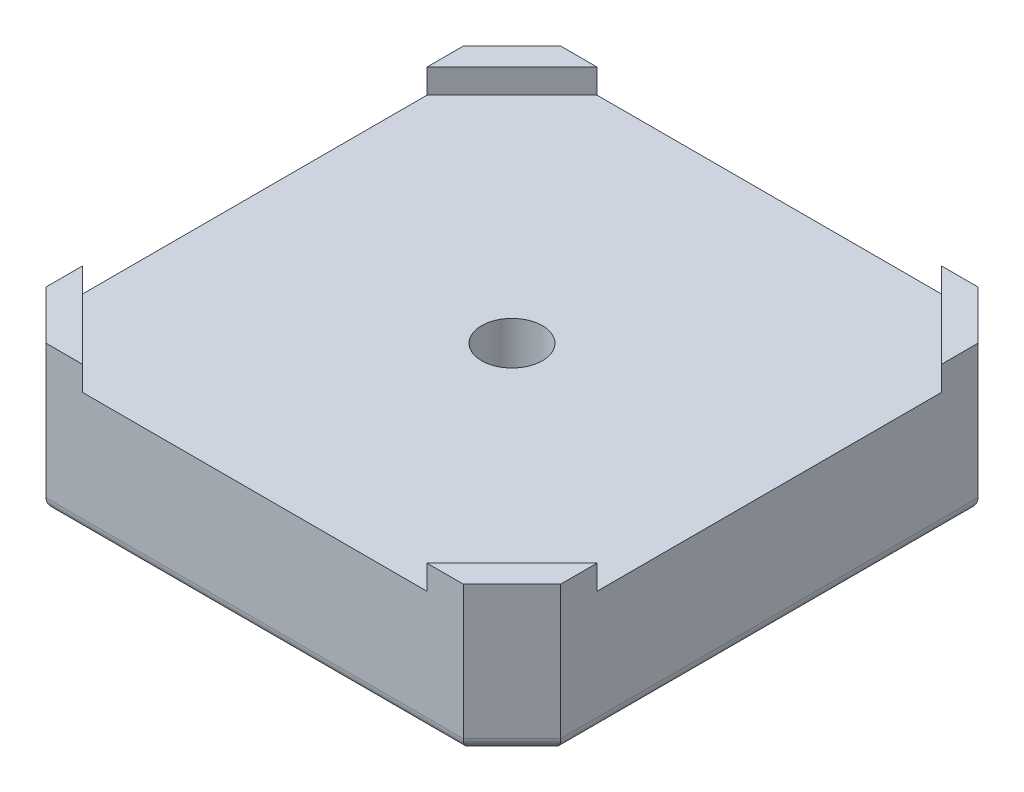
ISO-10303-21;
HEADER;
FILE_DESCRIPTION(('STEP AP214'),'2;1');
FILE_NAME('part.step','',(''),(''),'','','');
FILE_SCHEMA(('AUTOMOTIVE_DESIGN { 1 0 10303 214 1 1 1 1 }'));
ENDSEC;
DATA;
#1=APPLICATION_CONTEXT('core data for automotive mechanical design processes');
#2=APPLICATION_PROTOCOL_DEFINITION('international standard','automotive_design',2000,#1);
#3=PRODUCT_CONTEXT('',#1,'mechanical');
#4=PRODUCT('Part','Part','',(#3));
#5=PRODUCT_RELATED_PRODUCT_CATEGORY('part','',(#4));
#6=PRODUCT_DEFINITION_FORMATION('','',#4);
#7=PRODUCT_DEFINITION_CONTEXT('part definition',#1,'design');
#8=PRODUCT_DEFINITION('design','',#6,#7);
#9=PRODUCT_DEFINITION_SHAPE('','',#8);
#10=(LENGTH_UNIT() NAMED_UNIT(*) SI_UNIT(.MILLI.,.METRE.));
#11=(NAMED_UNIT(*) PLANE_ANGLE_UNIT() SI_UNIT($,.RADIAN.));
#12=(NAMED_UNIT(*) SI_UNIT($,.STERADIAN.) SOLID_ANGLE_UNIT());
#13=UNCERTAINTY_MEASURE_WITH_UNIT(LENGTH_MEASURE(1.E-05),#10,'distance_accuracy_value','');
#14=(GEOMETRIC_REPRESENTATION_CONTEXT(3) GLOBAL_UNCERTAINTY_ASSIGNED_CONTEXT((#13)) GLOBAL_UNIT_ASSIGNED_CONTEXT((#10,
#11,#12)) REPRESENTATION_CONTEXT('',''));
#15=CARTESIAN_POINT('',(0.,0.,0.));
#16=DIRECTION('',(0.,0.,1.));
#17=DIRECTION('',(1.,0.,0.));
#18=AXIS2_PLACEMENT_3D('',#15,#16,#17);
#19=CARTESIAN_POINT('',(0.,0.,0.));
#20=DIRECTION('',(0.,1.,0.));
#21=DIRECTION('',(0.,0.,1.));
#22=AXIS2_PLACEMENT_3D('',#19,#20,#21);
#23=PLANE('',#22);
#24=CARTESIAN_POINT('',(15.5,0.,-15.5));
#25=DIRECTION('',(0.,1.,0.));
#26=DIRECTION('',(0.,0.,1.));
#27=AXIS2_PLACEMENT_3D('',#24,#25,#26);
#28=CIRCLE('',#27,1.55);
#29=CARTESIAN_POINT('',(15.5,0.,-13.95));
#30=VERTEX_POINT('',#29);
#31=EDGE_CURVE('E401',#30,#30,#28,.T.);
#32=ORIENTED_EDGE('',*,*,#31,.T.);
#33=EDGE_LOOP('',(#32));
#34=FACE_BOUND('',#33,.T.);
#35=CARTESIAN_POINT('',(15.5,0.,15.5));
#36=DIRECTION('',(0.,1.,0.));
#37=DIRECTION('',(0.,0.,1.));
#38=AXIS2_PLACEMENT_3D('',#35,#36,#37);
#39=CIRCLE('',#38,1.55);
#40=CARTESIAN_POINT('',(15.5,0.,17.05));
#41=VERTEX_POINT('',#40);
#42=EDGE_CURVE('E398',#41,#41,#39,.T.);
#43=ORIENTED_EDGE('',*,*,#42,.T.);
#44=EDGE_LOOP('',(#43));
#45=FACE_BOUND('',#44,.T.);
#46=CARTESIAN_POINT('',(-15.5,0.,-15.5));
#47=DIRECTION('',(0.,1.,0.));
#48=DIRECTION('',(0.,0.,1.));
#49=AXIS2_PLACEMENT_3D('',#46,#47,#48);
#50=CIRCLE('',#49,1.55);
#51=CARTESIAN_POINT('',(-15.5,0.,-13.95));
#52=VERTEX_POINT('',#51);
#53=EDGE_CURVE('E395',#52,#52,#50,.T.);
#54=ORIENTED_EDGE('',*,*,#53,.T.);
#55=EDGE_LOOP('',(#54));
#56=FACE_BOUND('',#55,.T.);
#57=CARTESIAN_POINT('',(-15.5,0.,15.5));
#58=DIRECTION('',(0.,1.,0.));
#59=DIRECTION('',(0.,0.,1.));
#60=AXIS2_PLACEMENT_3D('',#57,#58,#59);
#61=CIRCLE('',#60,1.55);
#62=CARTESIAN_POINT('',(-15.5,0.,17.05));
#63=VERTEX_POINT('',#62);
#64=EDGE_CURVE('E392',#63,#63,#61,.T.);
#65=ORIENTED_EDGE('',*,*,#64,.T.);
#66=EDGE_LOOP('',(#65));
#67=FACE_BOUND('',#66,.T.);
#68=CARTESIAN_POINT('',(0.,0.,0.));
#69=DIRECTION('',(0.,1.,0.));
#70=DIRECTION('',(0.,0.,1.));
#71=AXIS2_PLACEMENT_3D('',#68,#69,#70);
#72=CIRCLE('',#71,11.5);
#73=CARTESIAN_POINT('',(0.,0.,11.5));
#74=VERTEX_POINT('',#73);
#75=EDGE_CURVE('E386',#74,#74,#72,.T.);
#76=ORIENTED_EDGE('',*,*,#75,.T.);
#77=EDGE_LOOP('',(#76));
#78=FACE_BOUND('',#77,.T.);
#79=DIRECTION('',(0.,0.,1.));
#80=VECTOR('',#79,1.);
#81=CARTESIAN_POINT('',(-20.15,0.,0.));
#82=LINE('',#81,#80);
#83=CARTESIAN_POINT('',(-20.15,0.,16.7357864376269));
#84=VERTEX_POINT('',#83);
#85=CARTESIAN_POINT('',(-20.15,0.,-16.7357864376269));
#86=VERTEX_POINT('',#85);
#87=EDGE_CURVE('E322',#84,#86,#82,.F.);
#88=ORIENTED_EDGE('',*,*,#87,.T.);
#89=DIRECTION('',(-0.707106781186548,0.,0.707106781186548));
#90=VECTOR('',#89,1.);
#91=CARTESIAN_POINT('',(-18.4428932188135,0.,-18.4428932188135));
#92=LINE('',#91,#90);
#93=CARTESIAN_POINT('',(-16.7357864376269,0.,-20.15));
#94=VERTEX_POINT('',#93);
#95=EDGE_CURVE('E336',#86,#94,#92,.F.);
#96=ORIENTED_EDGE('',*,*,#95,.T.);
#97=DIRECTION('',(-1.,0.,0.));
#98=VECTOR('',#97,1.);
#99=CARTESIAN_POINT('',(0.,0.,-20.15));
#100=LINE('',#99,#98);
#101=CARTESIAN_POINT('',(16.7357864376269,0.,-20.15));
#102=VERTEX_POINT('',#101);
#103=EDGE_CURVE('E334',#94,#102,#100,.F.);
#104=ORIENTED_EDGE('',*,*,#103,.T.);
#105=DIRECTION('',(-0.707106781186548,0.,-0.707106781186548));
#106=VECTOR('',#105,1.);
#107=CARTESIAN_POINT('',(18.4428932188134,0.,-18.4428932188134));
#108=LINE('',#107,#106);
#109=CARTESIAN_POINT('',(20.15,0.,-16.7357864376269));
#110=VERTEX_POINT('',#109);
#111=EDGE_CURVE('E332',#102,#110,#108,.F.);
#112=ORIENTED_EDGE('',*,*,#111,.T.);
#113=DIRECTION('',(0.,0.,-1.));
#114=VECTOR('',#113,1.);
#115=CARTESIAN_POINT('',(20.15,0.,0.));
#116=LINE('',#115,#114);
#117=CARTESIAN_POINT('',(20.15,0.,16.7357864376269));
#118=VERTEX_POINT('',#117);
#119=EDGE_CURVE('E330',#110,#118,#116,.F.);
#120=ORIENTED_EDGE('',*,*,#119,.T.);
#121=DIRECTION('',(0.707106781186548,0.,-0.707106781186548));
#122=VECTOR('',#121,1.);
#123=CARTESIAN_POINT('',(18.4428932188134,0.,18.4428932188134));
#124=LINE('',#123,#122);
#125=CARTESIAN_POINT('',(16.7357864376269,0.,20.15));
#126=VERTEX_POINT('',#125);
#127=EDGE_CURVE('E328',#118,#126,#124,.F.);
#128=ORIENTED_EDGE('',*,*,#127,.T.);
#129=DIRECTION('',(1.,0.,0.));
#130=VECTOR('',#129,1.);
#131=CARTESIAN_POINT('',(0.,0.,20.15));
#132=LINE('',#131,#130);
#133=CARTESIAN_POINT('',(-16.7357864376269,0.,20.15));
#134=VERTEX_POINT('',#133);
#135=EDGE_CURVE('E326',#126,#134,#132,.F.);
#136=ORIENTED_EDGE('',*,*,#135,.T.);
#137=DIRECTION('',(0.707106781186548,0.,0.707106781186548));
#138=VECTOR('',#137,1.);
#139=CARTESIAN_POINT('',(-18.4428932188135,0.,18.4428932188135));
#140=LINE('',#139,#138);
#141=EDGE_CURVE('E324',#134,#84,#140,.F.);
#142=ORIENTED_EDGE('',*,*,#141,.T.);
#143=EDGE_LOOP('',(#88,#96,#104,#112,#120,#128,#136,#142));
#144=FACE_BOUND('',#143,.T.);
#145=ADVANCED_FACE('F40',(#34,#45,#56,#67,#78,#144),#23,.F.);
#146=CARTESIAN_POINT('',(0.,0.,0.));
#147=DIRECTION('',(0.,1.,0.));
#148=DIRECTION('',(0.,0.,1.));
#149=AXIS2_PLACEMENT_3D('',#146,#147,#148);
#150=CYLINDRICAL_SURFACE('',#149,2.5);
#151=CARTESIAN_POINT('',(0.,10.,0.));
#152=DIRECTION('',(0.,1.,0.));
#153=DIRECTION('',(0.,0.,1.));
#154=AXIS2_PLACEMENT_3D('',#151,#152,#153);
#155=CIRCLE('',#154,2.5);
#156=CARTESIAN_POINT('',(0.,10.,2.5));
#157=VERTEX_POINT('',#156);
#158=EDGE_CURVE('E217',#157,#157,#155,.T.);
#159=ORIENTED_EDGE('',*,*,#158,.T.);
#160=EDGE_LOOP('',(#159));
#161=FACE_BOUND('',#160,.T.);
#162=CARTESIAN_POINT('',(0.,5.,0.));
#163=DIRECTION('',(0.,-1.,0.));
#164=DIRECTION('',(0.,0.,-1.));
#165=AXIS2_PLACEMENT_3D('',#162,#163,#164);
#166=CIRCLE('',#165,2.5);
#167=CARTESIAN_POINT('',(0.,5.,-2.5));
#168=VERTEX_POINT('',#167);
#169=EDGE_CURVE('E215',#168,#168,#166,.F.);
#170=ORIENTED_EDGE('',*,*,#169,.F.);
#171=EDGE_LOOP('',(#170));
#172=FACE_BOUND('',#171,.T.);
#173=ADVANCED_FACE('F426',(#161,#172),#150,.F.);
#174=CARTESIAN_POINT('',(0.,12.,0.));
#175=DIRECTION('',(0.,1.,0.));
#176=DIRECTION('',(0.,0.,1.));
#177=AXIS2_PLACEMENT_3D('',#174,#175,#176);
#178=PLANE('',#177);
#179=DIRECTION('',(-0.707106781186547,0.,0.707106781186547));
#180=VECTOR('',#179,1.);
#181=CARTESIAN_POINT('',(-21.15,12.,-14.15));
#182=LINE('',#181,#180);
#183=CARTESIAN_POINT('',(-14.15,12.,-21.15));
#184=VERTEX_POINT('',#183);
#185=CARTESIAN_POINT('',(-21.15,12.,-14.15));
#186=VERTEX_POINT('',#185);
#187=EDGE_CURVE('E220',#184,#186,#182,.T.);
#188=ORIENTED_EDGE('',*,*,#187,.F.);
#189=DIRECTION('',(-1.,0.,0.));
#190=VECTOR('',#189,1.);
#191=CARTESIAN_POINT('',(-17.15,12.,-21.15));
#192=LINE('',#191,#190);
#193=CARTESIAN_POINT('',(-17.15,12.,-21.15));
#194=VERTEX_POINT('',#193);
#195=EDGE_CURVE('E255',#184,#194,#192,.T.);
#196=ORIENTED_EDGE('',*,*,#195,.T.);
#197=DIRECTION('',(-0.707106781186548,0.,0.707106781186548));
#198=VECTOR('',#197,1.);
#199=CARTESIAN_POINT('',(-21.15,12.,-17.15));
#200=LINE('',#199,#198);
#201=CARTESIAN_POINT('',(-21.15,12.,-17.15));
#202=VERTEX_POINT('',#201);
#203=EDGE_CURVE('E276',#194,#202,#200,.T.);
#204=ORIENTED_EDGE('',*,*,#203,.T.);
#205=DIRECTION('',(0.,0.,1.));
#206=VECTOR('',#205,1.);
#207=CARTESIAN_POINT('',(-21.15,12.,17.15));
#208=LINE('',#207,#206);
#209=EDGE_CURVE('E279',#202,#186,#208,.T.);
#210=ORIENTED_EDGE('',*,*,#209,.T.);
#211=EDGE_LOOP('',(#188,#196,#204,#210));
#212=FACE_BOUND('',#211,.T.);
#213=ADVANCED_FACE('F432',(#212),#178,.T.);
#214=DIRECTION('',(-0.707106781186547,0.,-0.707106781186547));
#215=VECTOR('',#214,1.);
#216=CARTESIAN_POINT('',(21.15,12.,-14.15));
#217=LINE('',#216,#215);
#218=CARTESIAN_POINT('',(21.15,12.,-14.15));
#219=VERTEX_POINT('',#218);
#220=CARTESIAN_POINT('',(14.15,12.,-21.15));
#221=VERTEX_POINT('',#220);
#222=EDGE_CURVE('E225',#219,#221,#217,.T.);
#223=ORIENTED_EDGE('',*,*,#222,.F.);
#224=DIRECTION('',(0.,0.,-1.));
#225=VECTOR('',#224,1.);
#226=CARTESIAN_POINT('',(21.15,12.,17.15));
#227=LINE('',#226,#225);
#228=CARTESIAN_POINT('',(21.15,12.,-17.15));
#229=VERTEX_POINT('',#228);
#230=EDGE_CURVE('E290',#219,#229,#227,.T.);
#231=ORIENTED_EDGE('',*,*,#230,.T.);
#232=DIRECTION('',(-0.707106781186548,0.,-0.707106781186548));
#233=VECTOR('',#232,1.);
#234=CARTESIAN_POINT('',(21.15,12.,-17.15));
#235=LINE('',#234,#233);
#236=CARTESIAN_POINT('',(17.15,12.,-21.15));
#237=VERTEX_POINT('',#236);
#238=EDGE_CURVE('E294',#229,#237,#235,.T.);
#239=ORIENTED_EDGE('',*,*,#238,.T.);
#240=EDGE_CURVE('E273',#237,#221,#192,.T.);
#241=ORIENTED_EDGE('',*,*,#240,.T.);
#242=EDGE_LOOP('',(#223,#231,#239,#241));
#243=FACE_BOUND('',#242,.T.);
#244=ADVANCED_FACE('F621',(#243),#178,.T.);
#245=DIRECTION('',(0.707106781186547,0.,-0.707106781186547));
#246=VECTOR('',#245,1.);
#247=CARTESIAN_POINT('',(14.15,12.,21.15));
#248=LINE('',#247,#246);
#249=CARTESIAN_POINT('',(14.15,12.,21.15));
#250=VERTEX_POINT('',#249);
#251=CARTESIAN_POINT('',(21.15,12.,14.15));
#252=VERTEX_POINT('',#251);
#253=EDGE_CURVE('E250',#250,#252,#248,.T.);
#254=ORIENTED_EDGE('',*,*,#253,.F.);
#255=DIRECTION('',(1.,0.,0.));
#256=VECTOR('',#255,1.);
#257=CARTESIAN_POINT('',(-17.15,12.,21.15));
#258=LINE('',#257,#256);
#259=CARTESIAN_POINT('',(17.15,12.,21.15));
#260=VERTEX_POINT('',#259);
#261=EDGE_CURVE('E284',#250,#260,#258,.T.);
#262=ORIENTED_EDGE('',*,*,#261,.T.);
#263=DIRECTION('',(0.707106781186548,0.,-0.707106781186548));
#264=VECTOR('',#263,1.);
#265=CARTESIAN_POINT('',(17.15,12.,21.15));
#266=LINE('',#265,#264);
#267=CARTESIAN_POINT('',(21.15,12.,17.15));
#268=VERTEX_POINT('',#267);
#269=EDGE_CURVE('E288',#260,#268,#266,.T.);
#270=ORIENTED_EDGE('',*,*,#269,.T.);
#271=EDGE_CURVE('E291',#268,#252,#227,.T.);
#272=ORIENTED_EDGE('',*,*,#271,.T.);
#273=EDGE_LOOP('',(#254,#262,#270,#272));
#274=FACE_BOUND('',#273,.T.);
#275=ADVANCED_FACE('F469',(#274),#178,.T.);
#276=CARTESIAN_POINT('',(-17.15,12.,-21.15));
#277=DIRECTION('',(0.,0.,1.));
#278=DIRECTION('',(1.,0.,0.));
#279=AXIS2_PLACEMENT_3D('',#276,#277,#278);
#280=PLANE('',#279);
#281=DIRECTION('',(0.,-1.,0.));
#282=VECTOR('',#281,1.);
#283=CARTESIAN_POINT('',(17.15,12.,-21.15));
#284=LINE('',#283,#282);
#285=CARTESIAN_POINT('',(17.15,1.,-21.15));
#286=VERTEX_POINT('',#285);
#287=EDGE_CURVE('E296',#237,#286,#284,.T.);
#288=ORIENTED_EDGE('',*,*,#287,.T.);
#289=DIRECTION('',(-1.,0.,0.));
#290=VECTOR('',#289,1.);
#291=CARTESIAN_POINT('',(-17.15,1.,-21.15));
#292=LINE('',#291,#290);
#293=CARTESIAN_POINT('',(-17.15,1.,-21.15));
#294=VERTEX_POINT('',#293);
#295=EDGE_CURVE('E339',#286,#294,#292,.T.);
#296=ORIENTED_EDGE('',*,*,#295,.T.);
#297=DIRECTION('',(0.,-1.,0.));
#298=VECTOR('',#297,1.);
#299=CARTESIAN_POINT('',(-17.15,12.,-21.15));
#300=LINE('',#299,#298);
#301=EDGE_CURVE('E314',#194,#294,#300,.T.);
#302=ORIENTED_EDGE('',*,*,#301,.F.);
#303=ORIENTED_EDGE('',*,*,#195,.F.);
#304=DIRECTION('',(0.,1.,0.));
#305=VECTOR('',#304,1.);
#306=CARTESIAN_POINT('',(-14.15,10.,-21.15));
#307=LINE('',#306,#305);
#308=CARTESIAN_POINT('',(-14.15,10.,-21.15));
#309=VERTEX_POINT('',#308);
#310=EDGE_CURVE('E253',#309,#184,#307,.T.);
#311=ORIENTED_EDGE('',*,*,#310,.F.);
#312=DIRECTION('',(-1.,0.,0.));
#313=VECTOR('',#312,1.);
#314=CARTESIAN_POINT('',(-14.15,10.,-21.15));
#315=LINE('',#314,#313);
#316=CARTESIAN_POINT('',(14.15,10.,-21.15));
#317=VERTEX_POINT('',#316);
#318=EDGE_CURVE('E243',#317,#309,#315,.T.);
#319=ORIENTED_EDGE('',*,*,#318,.F.);
#320=DIRECTION('',(0.,1.,0.));
#321=VECTOR('',#320,1.);
#322=CARTESIAN_POINT('',(14.15,10.,-21.15));
#323=LINE('',#322,#321);
#324=EDGE_CURVE('E256',#317,#221,#323,.T.);
#325=ORIENTED_EDGE('',*,*,#324,.T.);
#326=ORIENTED_EDGE('',*,*,#240,.F.);
#327=EDGE_LOOP('',(#288,#296,#302,#303,#311,#319,#325,#326));
#328=FACE_BOUND('',#327,.T.);
#329=ADVANCED_FACE('F465',(#328),#280,.F.);
#330=CARTESIAN_POINT('',(-21.15,12.,-17.15));
#331=DIRECTION('',(0.707106781186547,0.,0.707106781186547));
#332=DIRECTION('',(0.707106781186548,0.,-0.707106781186548));
#333=AXIS2_PLACEMENT_3D('',#330,#331,#332);
#334=PLANE('',#333);
#335=ORIENTED_EDGE('',*,*,#301,.T.);
#336=DIRECTION('',(-0.707106781186548,0.,0.707106781186548));
#337=VECTOR('',#336,1.);
#338=CARTESIAN_POINT('',(-21.15,1.,-17.15));
#339=LINE('',#338,#337);
#340=CARTESIAN_POINT('',(-21.15,1.,-17.15));
#341=VERTEX_POINT('',#340);
#342=EDGE_CURVE('E317',#294,#341,#339,.T.);
#343=ORIENTED_EDGE('',*,*,#342,.T.);
#344=DIRECTION('',(0.,-1.,0.));
#345=VECTOR('',#344,1.);
#346=CARTESIAN_POINT('',(-21.15,12.,-17.15));
#347=LINE('',#346,#345);
#348=EDGE_CURVE('E312',#202,#341,#347,.T.);
#349=ORIENTED_EDGE('',*,*,#348,.F.);
#350=ORIENTED_EDGE('',*,*,#203,.F.);
#351=EDGE_LOOP('',(#335,#343,#349,#350));
#352=FACE_BOUND('',#351,.T.);
#353=ADVANCED_FACE('F462',(#352),#334,.F.);
#354=CARTESIAN_POINT('',(-21.15,12.,17.15));
#355=DIRECTION('',(1.,0.,0.));
#356=DIRECTION('',(0.,0.,-1.));
#357=AXIS2_PLACEMENT_3D('',#354,#355,#356);
#358=PLANE('',#357);
#359=ORIENTED_EDGE('',*,*,#348,.T.);
#360=DIRECTION('',(0.,0.,1.));
#361=VECTOR('',#360,1.);
#362=CARTESIAN_POINT('',(-21.15,1.,17.15));
#363=LINE('',#362,#361);
#364=CARTESIAN_POINT('',(-21.15,1.,17.15));
#365=VERTEX_POINT('',#364);
#366=EDGE_CURVE('E55',#341,#365,#363,.T.);
#367=ORIENTED_EDGE('',*,*,#366,.T.);
#368=DIRECTION('',(0.,-1.,0.));
#369=VECTOR('',#368,1.);
#370=CARTESIAN_POINT('',(-21.15,12.,17.15));
#371=LINE('',#370,#369);
#372=CARTESIAN_POINT('',(-21.15,12.,17.15));
#373=VERTEX_POINT('',#372);
#374=EDGE_CURVE('E310',#373,#365,#371,.T.);
#375=ORIENTED_EDGE('',*,*,#374,.F.);
#376=CARTESIAN_POINT('',(-21.15,12.,14.15));
#377=VERTEX_POINT('',#376);
#378=EDGE_CURVE('E278',#377,#373,#208,.T.);
#379=ORIENTED_EDGE('',*,*,#378,.F.);
#380=DIRECTION('',(0.,1.,0.));
#381=VECTOR('',#380,1.);
#382=CARTESIAN_POINT('',(-21.15,10.,14.15));
#383=LINE('',#382,#381);
#384=CARTESIAN_POINT('',(-21.15,10.,14.15));
#385=VERTEX_POINT('',#384);
#386=EDGE_CURVE('E269',#385,#377,#383,.T.);
#387=ORIENTED_EDGE('',*,*,#386,.F.);
#388=DIRECTION('',(0.,0.,1.));
#389=VECTOR('',#388,1.);
#390=CARTESIAN_POINT('',(-21.15,10.,14.15));
#391=LINE('',#390,#389);
#392=CARTESIAN_POINT('',(-21.15,10.,-14.15));
#393=VERTEX_POINT('',#392);
#394=EDGE_CURVE('E224',#393,#385,#391,.T.);
#395=ORIENTED_EDGE('',*,*,#394,.F.);
#396=DIRECTION('',(0.,1.,0.));
#397=VECTOR('',#396,1.);
#398=CARTESIAN_POINT('',(-21.15,10.,-14.15));
#399=LINE('',#398,#397);
#400=EDGE_CURVE('E246',#393,#186,#399,.T.);
#401=ORIENTED_EDGE('',*,*,#400,.T.);
#402=ORIENTED_EDGE('',*,*,#209,.F.);
#403=EDGE_LOOP('',(#359,#367,#375,#379,#387,#395,#401,#402));
#404=FACE_BOUND('',#403,.T.);
#405=ADVANCED_FACE('F459',(#404),#358,.F.);
#406=CARTESIAN_POINT('',(-21.15,12.,17.15));
#407=DIRECTION('',(0.707106781186547,0.,-0.707106781186547));
#408=DIRECTION('',(-0.707106781186548,0.,-0.707106781186548));
#409=AXIS2_PLACEMENT_3D('',#406,#407,#408);
#410=PLANE('',#409);
#411=ORIENTED_EDGE('',*,*,#374,.T.);
#412=DIRECTION('',(0.707106781186548,0.,0.707106781186548));
#413=VECTOR('',#412,1.);
#414=CARTESIAN_POINT('',(-21.15,1.,17.15));
#415=LINE('',#414,#413);
#416=CARTESIAN_POINT('',(-17.15,1.,21.15));
#417=VERTEX_POINT('',#416);
#418=EDGE_CURVE('E62',#365,#417,#415,.T.);
#419=ORIENTED_EDGE('',*,*,#418,.T.);
#420=DIRECTION('',(0.,-1.,0.));
#421=VECTOR('',#420,1.);
#422=CARTESIAN_POINT('',(-17.15,12.,21.15));
#423=LINE('',#422,#421);
#424=CARTESIAN_POINT('',(-17.15,12.,21.15));
#425=VERTEX_POINT('',#424);
#426=EDGE_CURVE('E308',#425,#417,#423,.T.);
#427=ORIENTED_EDGE('',*,*,#426,.F.);
#428=DIRECTION('',(0.707106781186548,0.,0.707106781186548));
#429=VECTOR('',#428,1.);
#430=CARTESIAN_POINT('',(-21.15,12.,17.15));
#431=LINE('',#430,#429);
#432=EDGE_CURVE('E282',#373,#425,#431,.T.);
#433=ORIENTED_EDGE('',*,*,#432,.F.);
#434=EDGE_LOOP('',(#411,#419,#427,#433));
#435=FACE_BOUND('',#434,.T.);
#436=ADVANCED_FACE('F455',(#435),#410,.F.);
#437=CARTESIAN_POINT('',(-17.15,12.,21.15));
#438=DIRECTION('',(0.,0.,-1.));
#439=DIRECTION('',(-1.,0.,0.));
#440=AXIS2_PLACEMENT_3D('',#437,#438,#439);
#441=PLANE('',#440);
#442=ORIENTED_EDGE('',*,*,#426,.T.);
#443=DIRECTION('',(1.,0.,0.));
#444=VECTOR('',#443,1.);
#445=CARTESIAN_POINT('',(-17.15,1.,21.15));
#446=LINE('',#445,#444);
#447=CARTESIAN_POINT('',(17.15,1.,21.15));
#448=VERTEX_POINT('',#447);
#449=EDGE_CURVE('E347',#417,#448,#446,.T.);
#450=ORIENTED_EDGE('',*,*,#449,.T.);
#451=DIRECTION('',(0.,-1.,0.));
#452=VECTOR('',#451,1.);
#453=CARTESIAN_POINT('',(17.15,12.,21.15));
#454=LINE('',#453,#452);
#455=EDGE_CURVE('E305',#260,#448,#454,.T.);
#456=ORIENTED_EDGE('',*,*,#455,.F.);
#457=ORIENTED_EDGE('',*,*,#261,.F.);
#458=DIRECTION('',(0.,1.,0.));
#459=VECTOR('',#458,1.);
#460=CARTESIAN_POINT('',(14.15,10.,21.15));
#461=LINE('',#460,#459);
#462=CARTESIAN_POINT('',(14.15,10.,21.15));
#463=VERTEX_POINT('',#462);
#464=EDGE_CURVE('E264',#463,#250,#461,.T.);
#465=ORIENTED_EDGE('',*,*,#464,.F.);
#466=DIRECTION('',(1.,0.,0.));
#467=VECTOR('',#466,1.);
#468=CARTESIAN_POINT('',(-14.15,10.,21.15));
#469=LINE('',#468,#467);
#470=CARTESIAN_POINT('',(-14.15,10.,21.15));
#471=VERTEX_POINT('',#470);
#472=EDGE_CURVE('E231',#471,#463,#469,.T.);
#473=ORIENTED_EDGE('',*,*,#472,.F.);
#474=DIRECTION('',(0.,1.,0.));
#475=VECTOR('',#474,1.);
#476=CARTESIAN_POINT('',(-14.15,10.,21.15));
#477=LINE('',#476,#475);
#478=CARTESIAN_POINT('',(-14.15,12.,21.15));
#479=VERTEX_POINT('',#478);
#480=EDGE_CURVE('E266',#471,#479,#477,.T.);
#481=ORIENTED_EDGE('',*,*,#480,.T.);
#482=EDGE_CURVE('E285',#425,#479,#258,.T.);
#483=ORIENTED_EDGE('',*,*,#482,.F.);
#484=EDGE_LOOP('',(#442,#450,#456,#457,#465,#473,#481,#483));
#485=FACE_BOUND('',#484,.T.);
#486=ADVANCED_FACE('F451',(#485),#441,.F.);
#487=CARTESIAN_POINT('',(17.15,12.,21.15));
#488=DIRECTION('',(-0.707106781186547,0.,-0.707106781186547));
#489=DIRECTION('',(-0.707106781186548,0.,0.707106781186548));
#490=AXIS2_PLACEMENT_3D('',#487,#488,#489);
#491=PLANE('',#490);
#492=ORIENTED_EDGE('',*,*,#455,.T.);
#493=DIRECTION('',(0.707106781186548,0.,-0.707106781186548));
#494=VECTOR('',#493,1.);
#495=CARTESIAN_POINT('',(17.15,1.,21.15));
#496=LINE('',#495,#494);
#497=CARTESIAN_POINT('',(21.15,1.,17.15));
#498=VERTEX_POINT('',#497);
#499=EDGE_CURVE('E345',#448,#498,#496,.T.);
#500=ORIENTED_EDGE('',*,*,#499,.T.);
#501=DIRECTION('',(0.,-1.,0.));
#502=VECTOR('',#501,1.);
#503=CARTESIAN_POINT('',(21.15,12.,17.15));
#504=LINE('',#503,#502);
#505=EDGE_CURVE('E302',#268,#498,#504,.T.);
#506=ORIENTED_EDGE('',*,*,#505,.F.);
#507=ORIENTED_EDGE('',*,*,#269,.F.);
#508=EDGE_LOOP('',(#492,#500,#506,#507));
#509=FACE_BOUND('',#508,.T.);
#510=ADVANCED_FACE('F447',(#509),#491,.F.);
#511=CARTESIAN_POINT('',(21.15,12.,17.15));
#512=DIRECTION('',(-1.,0.,0.));
#513=DIRECTION('',(0.,0.,1.));
#514=AXIS2_PLACEMENT_3D('',#511,#512,#513);
#515=PLANE('',#514);
#516=ORIENTED_EDGE('',*,*,#505,.T.);
#517=DIRECTION('',(0.,0.,-1.));
#518=VECTOR('',#517,1.);
#519=CARTESIAN_POINT('',(21.15,1.,17.15));
#520=LINE('',#519,#518);
#521=CARTESIAN_POINT('',(21.15,1.,-17.15));
#522=VERTEX_POINT('',#521);
#523=EDGE_CURVE('E343',#498,#522,#520,.T.);
#524=ORIENTED_EDGE('',*,*,#523,.T.);
#525=DIRECTION('',(0.,-1.,0.));
#526=VECTOR('',#525,1.);
#527=CARTESIAN_POINT('',(21.15,12.,-17.15));
#528=LINE('',#527,#526);
#529=EDGE_CURVE('E299',#229,#522,#528,.T.);
#530=ORIENTED_EDGE('',*,*,#529,.F.);
#531=ORIENTED_EDGE('',*,*,#230,.F.);
#532=DIRECTION('',(0.,1.,0.));
#533=VECTOR('',#532,1.);
#534=CARTESIAN_POINT('',(21.15,10.,-14.15));
#535=LINE('',#534,#533);
#536=CARTESIAN_POINT('',(21.15,10.,-14.15));
#537=VERTEX_POINT('',#536);
#538=EDGE_CURVE('E259',#537,#219,#535,.T.);
#539=ORIENTED_EDGE('',*,*,#538,.F.);
#540=DIRECTION('',(0.,0.,-1.));
#541=VECTOR('',#540,1.);
#542=CARTESIAN_POINT('',(21.15,10.,14.15));
#543=LINE('',#542,#541);
#544=CARTESIAN_POINT('',(21.15,10.,14.15));
#545=VERTEX_POINT('',#544);
#546=EDGE_CURVE('E237',#545,#537,#543,.T.);
#547=ORIENTED_EDGE('',*,*,#546,.F.);
#548=DIRECTION('',(0.,1.,0.));
#549=VECTOR('',#548,1.);
#550=CARTESIAN_POINT('',(21.15,10.,14.15));
#551=LINE('',#550,#549);
#552=EDGE_CURVE('E261',#545,#252,#551,.T.);
#553=ORIENTED_EDGE('',*,*,#552,.T.);
#554=ORIENTED_EDGE('',*,*,#271,.F.);
#555=EDGE_LOOP('',(#516,#524,#530,#531,#539,#547,#553,#554));
#556=FACE_BOUND('',#555,.T.);
#557=ADVANCED_FACE('F443',(#556),#515,.F.);
#558=CARTESIAN_POINT('',(21.15,12.,-17.15));
#559=DIRECTION('',(-0.707106781186547,0.,0.707106781186547));
#560=DIRECTION('',(0.707106781186548,0.,0.707106781186548));
#561=AXIS2_PLACEMENT_3D('',#558,#559,#560);
#562=PLANE('',#561);
#563=ORIENTED_EDGE('',*,*,#529,.T.);
#564=DIRECTION('',(-0.707106781186548,0.,-0.707106781186548));
#565=VECTOR('',#564,1.);
#566=CARTESIAN_POINT('',(21.15,1.,-17.15));
#567=LINE('',#566,#565);
#568=EDGE_CURVE('E341',#522,#286,#567,.T.);
#569=ORIENTED_EDGE('',*,*,#568,.T.);
#570=ORIENTED_EDGE('',*,*,#287,.F.);
#571=ORIENTED_EDGE('',*,*,#238,.F.);
#572=EDGE_LOOP('',(#563,#569,#570,#571));
#573=FACE_BOUND('',#572,.T.);
#574=ADVANCED_FACE('F440',(#573),#562,.F.);
#575=DIRECTION('',(0.707106781186547,0.,0.707106781186547));
#576=VECTOR('',#575,1.);
#577=CARTESIAN_POINT('',(-21.15,12.,14.15));
#578=LINE('',#577,#576);
#579=EDGE_CURVE('E248',#377,#479,#578,.T.);
#580=ORIENTED_EDGE('',*,*,#579,.F.);
#581=ORIENTED_EDGE('',*,*,#378,.T.);
#582=ORIENTED_EDGE('',*,*,#432,.T.);
#583=ORIENTED_EDGE('',*,*,#482,.T.);
#584=EDGE_LOOP('',(#580,#581,#582,#583));
#585=FACE_BOUND('',#584,.T.);
#586=ADVANCED_FACE('F438',(#585),#178,.T.);
#587=CARTESIAN_POINT('',(-21.15,10.,-14.15));
#588=DIRECTION('',(-0.707106781186547,0.,-0.707106781186547));
#589=DIRECTION('',(-0.707106781186548,0.,0.707106781186548));
#590=AXIS2_PLACEMENT_3D('',#587,#588,#589);
#591=PLANE('',#590);
#592=ORIENTED_EDGE('',*,*,#187,.T.);
#593=ORIENTED_EDGE('',*,*,#400,.F.);
#594=DIRECTION('',(-0.707106781186547,0.,0.707106781186547));
#595=VECTOR('',#594,1.);
#596=CARTESIAN_POINT('',(-21.15,10.,-14.15));
#597=LINE('',#596,#595);
#598=EDGE_CURVE('E221',#309,#393,#597,.T.);
#599=ORIENTED_EDGE('',*,*,#598,.F.);
#600=ORIENTED_EDGE('',*,*,#310,.T.);
#601=EDGE_LOOP('',(#592,#593,#599,#600));
#602=FACE_BOUND('',#601,.T.);
#603=ADVANCED_FACE('F566',(#602),#591,.F.);
#604=CARTESIAN_POINT('',(21.15,10.,-14.15));
#605=DIRECTION('',(0.707106781186547,0.,-0.707106781186547));
#606=DIRECTION('',(-0.707106781186548,0.,-0.707106781186548));
#607=AXIS2_PLACEMENT_3D('',#604,#605,#606);
#608=PLANE('',#607);
#609=ORIENTED_EDGE('',*,*,#222,.T.);
#610=ORIENTED_EDGE('',*,*,#324,.F.);
#611=DIRECTION('',(-0.707106781186547,0.,-0.707106781186547));
#612=VECTOR('',#611,1.);
#613=CARTESIAN_POINT('',(21.15,10.,-14.15));
#614=LINE('',#613,#612);
#615=EDGE_CURVE('E240',#537,#317,#614,.T.);
#616=ORIENTED_EDGE('',*,*,#615,.F.);
#617=ORIENTED_EDGE('',*,*,#538,.T.);
#618=EDGE_LOOP('',(#609,#610,#616,#617));
#619=FACE_BOUND('',#618,.T.);
#620=ADVANCED_FACE('F562',(#619),#608,.F.);
#621=CARTESIAN_POINT('',(14.15,10.,21.15));
#622=DIRECTION('',(0.707106781186547,0.,0.707106781186547));
#623=DIRECTION('',(0.707106781186548,0.,-0.707106781186548));
#624=AXIS2_PLACEMENT_3D('',#621,#622,#623);
#625=PLANE('',#624);
#626=ORIENTED_EDGE('',*,*,#253,.T.);
#627=ORIENTED_EDGE('',*,*,#552,.F.);
#628=DIRECTION('',(0.707106781186547,0.,-0.707106781186547));
#629=VECTOR('',#628,1.);
#630=CARTESIAN_POINT('',(14.15,10.,21.15));
#631=LINE('',#630,#629);
#632=EDGE_CURVE('E234',#463,#545,#631,.T.);
#633=ORIENTED_EDGE('',*,*,#632,.F.);
#634=ORIENTED_EDGE('',*,*,#464,.T.);
#635=EDGE_LOOP('',(#626,#627,#633,#634));
#636=FACE_BOUND('',#635,.T.);
#637=ADVANCED_FACE('F565',(#636),#625,.F.);
#638=CARTESIAN_POINT('',(-21.15,10.,14.15));
#639=DIRECTION('',(-0.707106781186547,0.,0.707106781186547));
#640=DIRECTION('',(0.707106781186548,0.,0.707106781186548));
#641=AXIS2_PLACEMENT_3D('',#638,#639,#640);
#642=PLANE('',#641);
#643=ORIENTED_EDGE('',*,*,#579,.T.);
#644=ORIENTED_EDGE('',*,*,#480,.F.);
#645=DIRECTION('',(0.707106781186547,0.,0.707106781186547));
#646=VECTOR('',#645,1.);
#647=CARTESIAN_POINT('',(-21.15,10.,14.15));
#648=LINE('',#647,#646);
#649=EDGE_CURVE('E228',#385,#471,#648,.T.);
#650=ORIENTED_EDGE('',*,*,#649,.F.);
#651=ORIENTED_EDGE('',*,*,#386,.T.);
#652=EDGE_LOOP('',(#643,#644,#650,#651));
#653=FACE_BOUND('',#652,.T.);
#654=ADVANCED_FACE('F560',(#653),#642,.F.);
#655=CARTESIAN_POINT('',(0.,10.,0.));
#656=DIRECTION('',(0.,1.,0.));
#657=DIRECTION('',(0.,0.,1.));
#658=AXIS2_PLACEMENT_3D('',#655,#656,#657);
#659=PLANE('',#658);
#660=ORIENTED_EDGE('',*,*,#158,.F.);
#661=EDGE_LOOP('',(#660));
#662=FACE_BOUND('',#661,.T.);
#663=ORIENTED_EDGE('',*,*,#598,.T.);
#664=ORIENTED_EDGE('',*,*,#394,.T.);
#665=ORIENTED_EDGE('',*,*,#649,.T.);
#666=ORIENTED_EDGE('',*,*,#472,.T.);
#667=ORIENTED_EDGE('',*,*,#632,.T.);
#668=ORIENTED_EDGE('',*,*,#546,.T.);
#669=ORIENTED_EDGE('',*,*,#615,.T.);
#670=ORIENTED_EDGE('',*,*,#318,.T.);
#671=EDGE_LOOP('',(#663,#664,#665,#666,#667,#668,#669,#670));
#672=FACE_BOUND('',#671,.T.);
#673=ADVANCED_FACE('F553',(#662,#672),#659,.T.);
#674=CARTESIAN_POINT('',(0.,5.,0.));
#675=DIRECTION('',(0.,-1.,0.));
#676=DIRECTION('',(0.,0.,-1.));
#677=AXIS2_PLACEMENT_3D('',#674,#675,#676);
#678=PLANE('',#677);
#679=CARTESIAN_POINT('',(0.,5.,0.));
#680=DIRECTION('',(0.,-1.,0.));
#681=DIRECTION('',(0.,0.,-1.));
#682=AXIS2_PLACEMENT_3D('',#679,#680,#681);
#683=CIRCLE('',#682,5.5);
#684=CARTESIAN_POINT('',(0.,5.,-5.5));
#685=VERTEX_POINT('',#684);
#686=EDGE_CURVE('E212',#685,#685,#683,.T.);
#687=ORIENTED_EDGE('',*,*,#686,.T.);
#688=EDGE_LOOP('',(#687));
#689=FACE_BOUND('',#688,.T.);
#690=ORIENTED_EDGE('',*,*,#169,.T.);
#691=EDGE_LOOP('',(#690));
#692=FACE_BOUND('',#691,.T.);
#693=ADVANCED_FACE('F550',(#689,#692),#678,.T.);
#694=CARTESIAN_POINT('',(0.,5.,0.));
#695=DIRECTION('',(0.,-1.,0.));
#696=DIRECTION('',(0.,0.,-1.));
#697=AXIS2_PLACEMENT_3D('',#694,#695,#696);
#698=CYLINDRICAL_SURFACE('',#697,5.5);
#699=CARTESIAN_POINT('',(0.,-1.5,0.));
#700=DIRECTION('',(0.,-1.,0.));
#701=DIRECTION('',(0.,0.,-1.));
#702=AXIS2_PLACEMENT_3D('',#699,#700,#701);
#703=CIRCLE('',#702,5.5);
#704=CARTESIAN_POINT('',(0.,-1.5,-5.5));
#705=VERTEX_POINT('',#704);
#706=EDGE_CURVE('E351',#705,#705,#703,.T.);
#707=ORIENTED_EDGE('',*,*,#706,.T.);
#708=EDGE_LOOP('',(#707));
#709=FACE_BOUND('',#708,.T.);
#710=ORIENTED_EDGE('',*,*,#686,.F.);
#711=EDGE_LOOP('',(#710));
#712=FACE_BOUND('',#711,.T.);
#713=ADVANCED_FACE('F545',(#709,#712),#698,.F.);
#714=CARTESIAN_POINT('',(0.,-2.,0.));
#715=DIRECTION('',(0.,-1.,0.));
#716=DIRECTION('',(0.,0.,-1.));
#717=AXIS2_PLACEMENT_3D('',#714,#715,#716);
#718=PLANE('',#717);
#719=CARTESIAN_POINT('',(0.,-2.,0.));
#720=DIRECTION('',(0.,-1.,0.));
#721=DIRECTION('',(0.,0.,-1.));
#722=AXIS2_PLACEMENT_3D('',#719,#720,#721);
#723=CIRCLE('',#722,6.);
#724=CARTESIAN_POINT('',(0.,-2.,-6.));
#725=VERTEX_POINT('',#724);
#726=EDGE_CURVE('E377',#725,#725,#723,.F.);
#727=ORIENTED_EDGE('',*,*,#726,.T.);
#728=EDGE_LOOP('',(#727));
#729=FACE_BOUND('',#728,.T.);
#730=CARTESIAN_POINT('',(0.,-2.,0.));
#731=DIRECTION('',(0.,-1.,0.));
#732=DIRECTION('',(0.,0.,-1.));
#733=AXIS2_PLACEMENT_3D('',#730,#731,#732);
#734=CIRCLE('',#733,10.5);
#735=CARTESIAN_POINT('',(0.,-2.,-10.5));
#736=VERTEX_POINT('',#735);
#737=EDGE_CURVE('E374',#736,#736,#734,.T.);
#738=ORIENTED_EDGE('',*,*,#737,.T.);
#739=EDGE_LOOP('',(#738));
#740=FACE_BOUND('',#739,.T.);
#741=ADVANCED_FACE('F542',(#729,#740),#718,.T.);
#742=CARTESIAN_POINT('',(0.,-2.,0.));
#743=DIRECTION('',(0.,1.,0.));
#744=DIRECTION('',(0.,0.,1.));
#745=AXIS2_PLACEMENT_3D('',#742,#743,#744);
#746=CYLINDRICAL_SURFACE('',#745,11.);
#747=CARTESIAN_POINT('',(0.,-1.5,0.));
#748=DIRECTION('',(0.,-1.,0.));
#749=DIRECTION('',(0.,0.,-1.));
#750=AXIS2_PLACEMENT_3D('',#747,#748,#749);
#751=CIRCLE('',#750,11.);
#752=CARTESIAN_POINT('',(0.,-1.5,-11.));
#753=VERTEX_POINT('',#752);
#754=EDGE_CURVE('E383',#753,#753,#751,.F.);
#755=ORIENTED_EDGE('',*,*,#754,.T.);
#756=EDGE_LOOP('',(#755));
#757=FACE_BOUND('',#756,.T.);
#758=CARTESIAN_POINT('',(0.,-0.5,0.));
#759=DIRECTION('',(0.,1.,0.));
#760=DIRECTION('',(0.,0.,1.));
#761=AXIS2_PLACEMENT_3D('',#758,#759,#760);
#762=CIRCLE('',#761,11.);
#763=CARTESIAN_POINT('',(0.,-0.5,11.));
#764=VERTEX_POINT('',#763);
#765=EDGE_CURVE('E380',#764,#764,#762,.F.);
#766=ORIENTED_EDGE('',*,*,#765,.T.);
#767=EDGE_LOOP('',(#766));
#768=FACE_BOUND('',#767,.T.);
#769=ADVANCED_FACE('F503',(#757,#768),#746,.T.);
#770=CARTESIAN_POINT('',(16.4428932188134,1.,20.4428932188134));
#771=DIRECTION('',(0.707106781186548,0.,-0.707106781186548));
#772=DIRECTION('',(-0.707106781186548,0.,-0.707106781186548));
#773=AXIS2_PLACEMENT_3D('',#770,#771,#772);
#774=CYLINDRICAL_SURFACE('',#773,1.);
#775=CARTESIAN_POINT('',(16.7357864376269,1.,20.15));
#776=DIRECTION('',(0.923879532511287,0.,-0.38268343236509));
#777=DIRECTION('',(0.38268343236509,0.,0.923879532511287));
#778=AXIS2_PLACEMENT_3D('',#775,#776,#777);
#779=ELLIPSE('',#778,1.08239220029239,1.);
#780=EDGE_CURVE('E367',#126,#448,#779,.F.);
#781=ORIENTED_EDGE('',*,*,#780,.F.);
#782=ORIENTED_EDGE('',*,*,#127,.F.);
#783=CARTESIAN_POINT('',(20.15,1.,16.7357864376269));
#784=DIRECTION('',(0.38268343236509,0.,-0.923879532511287));
#785=DIRECTION('',(0.923879532511287,0.,0.38268343236509));
#786=AXIS2_PLACEMENT_3D('',#783,#784,#785);
#787=ELLIPSE('',#786,1.08239220029239,1.);
#788=EDGE_CURVE('E216',#498,#118,#787,.T.);
#789=ORIENTED_EDGE('',*,*,#788,.F.);
#790=ORIENTED_EDGE('',*,*,#499,.F.);
#791=EDGE_LOOP('',(#781,#782,#789,#790));
#792=FACE_BOUND('',#791,.T.);
#793=ADVANCED_FACE('F499',(#792),#774,.T.);
#794=CARTESIAN_POINT('',(20.15,1.,17.15));
#795=DIRECTION('',(0.,0.,-1.));
#796=DIRECTION('',(-1.,0.,0.));
#797=AXIS2_PLACEMENT_3D('',#794,#795,#796);
#798=CYLINDRICAL_SURFACE('',#797,1.);
#799=ORIENTED_EDGE('',*,*,#788,.T.);
#800=ORIENTED_EDGE('',*,*,#119,.F.);
#801=CARTESIAN_POINT('',(20.15,1.,-16.7357864376269));
#802=DIRECTION('',(-0.38268343236509,0.,-0.923879532511287));
#803=DIRECTION('',(0.923879532511287,0.,-0.38268343236509));
#804=AXIS2_PLACEMENT_3D('',#801,#802,#803);
#805=ELLIPSE('',#804,1.08239220029239,1.);
#806=EDGE_CURVE('E364',#522,#110,#805,.T.);
#807=ORIENTED_EDGE('',*,*,#806,.F.);
#808=ORIENTED_EDGE('',*,*,#523,.F.);
#809=EDGE_LOOP('',(#799,#800,#807,#808));
#810=FACE_BOUND('',#809,.T.);
#811=ADVANCED_FACE('F495',(#810),#798,.T.);
#812=CARTESIAN_POINT('',(-17.15,1.,20.15));
#813=DIRECTION('',(1.,0.,0.));
#814=DIRECTION('',(0.,0.,-1.));
#815=AXIS2_PLACEMENT_3D('',#812,#813,#814);
#816=CYLINDRICAL_SURFACE('',#815,1.);
#817=ORIENTED_EDGE('',*,*,#780,.T.);
#818=ORIENTED_EDGE('',*,*,#449,.F.);
#819=CARTESIAN_POINT('',(-16.7357864376269,1.,20.15));
#820=DIRECTION('',(0.923879532511287,0.,0.38268343236509));
#821=DIRECTION('',(-0.38268343236509,0.,0.923879532511287));
#822=AXIS2_PLACEMENT_3D('',#819,#820,#821);
#823=ELLIPSE('',#822,1.08239220029239,1.);
#824=EDGE_CURVE('E361',#134,#417,#823,.F.);
#825=ORIENTED_EDGE('',*,*,#824,.F.);
#826=ORIENTED_EDGE('',*,*,#135,.F.);
#827=EDGE_LOOP('',(#817,#818,#825,#826));
#828=FACE_BOUND('',#827,.T.);
#829=ADVANCED_FACE('F491',(#828),#816,.T.);
#830=CARTESIAN_POINT('',(20.4428932188134,1.,-16.4428932188134));
#831=DIRECTION('',(-0.707106781186548,0.,-0.707106781186548));
#832=DIRECTION('',(-0.707106781186548,0.,0.707106781186548));
#833=AXIS2_PLACEMENT_3D('',#830,#831,#832);
#834=CYLINDRICAL_SURFACE('',#833,1.);
#835=ORIENTED_EDGE('',*,*,#806,.T.);
#836=ORIENTED_EDGE('',*,*,#111,.F.);
#837=CARTESIAN_POINT('',(16.7357864376269,1.,-20.15));
#838=DIRECTION('',(-0.923879532511287,0.,-0.38268343236509));
#839=DIRECTION('',(0.38268343236509,0.,-0.923879532511287));
#840=AXIS2_PLACEMENT_3D('',#837,#838,#839);
#841=ELLIPSE('',#840,1.08239220029239,1.);
#842=EDGE_CURVE('E358',#286,#102,#841,.T.);
#843=ORIENTED_EDGE('',*,*,#842,.F.);
#844=ORIENTED_EDGE('',*,*,#568,.F.);
#845=EDGE_LOOP('',(#835,#836,#843,#844));
#846=FACE_BOUND('',#845,.T.);
#847=ADVANCED_FACE('F487',(#846),#834,.T.);
#848=CARTESIAN_POINT('',(-20.4428932188135,1.,16.4428932188134));
#849=DIRECTION('',(0.707106781186548,0.,0.707106781186548));
#850=DIRECTION('',(0.707106781186548,0.,-0.707106781186548));
#851=AXIS2_PLACEMENT_3D('',#848,#849,#850);
#852=CYLINDRICAL_SURFACE('',#851,1.);
#853=ORIENTED_EDGE('',*,*,#824,.T.);
#854=ORIENTED_EDGE('',*,*,#418,.F.);
#855=CARTESIAN_POINT('',(-20.15,1.,16.7357864376269));
#856=DIRECTION('',(0.38268343236509,0.,0.923879532511287));
#857=DIRECTION('',(-0.923879532511287,0.,0.38268343236509));
#858=AXIS2_PLACEMENT_3D('',#855,#856,#857);
#859=ELLIPSE('',#858,1.08239220029239,1.);
#860=EDGE_CURVE('E355',#84,#365,#859,.F.);
#861=ORIENTED_EDGE('',*,*,#860,.F.);
#862=ORIENTED_EDGE('',*,*,#141,.F.);
#863=EDGE_LOOP('',(#853,#854,#861,#862));
#864=FACE_BOUND('',#863,.T.);
#865=ADVANCED_FACE('F483',(#864),#852,.T.);
#866=CARTESIAN_POINT('',(-17.15,1.,-20.15));
#867=DIRECTION('',(-1.,0.,0.));
#868=DIRECTION('',(0.,0.,1.));
#869=AXIS2_PLACEMENT_3D('',#866,#867,#868);
#870=CYLINDRICAL_SURFACE('',#869,1.);
#871=ORIENTED_EDGE('',*,*,#842,.T.);
#872=ORIENTED_EDGE('',*,*,#103,.F.);
#873=CARTESIAN_POINT('',(-16.7357864376269,1.,-20.15));
#874=DIRECTION('',(-0.923879532511287,0.,0.38268343236509));
#875=DIRECTION('',(-0.38268343236509,0.,-0.923879532511287));
#876=AXIS2_PLACEMENT_3D('',#873,#874,#875);
#877=ELLIPSE('',#876,1.08239220029239,1.);
#878=EDGE_CURVE('E353',#294,#94,#877,.T.);
#879=ORIENTED_EDGE('',*,*,#878,.F.);
#880=ORIENTED_EDGE('',*,*,#295,.F.);
#881=EDGE_LOOP('',(#871,#872,#879,#880));
#882=FACE_BOUND('',#881,.T.);
#883=ADVANCED_FACE('F479',(#882),#870,.T.);
#884=CARTESIAN_POINT('',(-20.15,1.,17.15));
#885=DIRECTION('',(0.,0.,1.));
#886=DIRECTION('',(1.,0.,0.));
#887=AXIS2_PLACEMENT_3D('',#884,#885,#886);
#888=CYLINDRICAL_SURFACE('',#887,1.);
#889=ORIENTED_EDGE('',*,*,#860,.T.);
#890=ORIENTED_EDGE('',*,*,#366,.F.);
#891=CARTESIAN_POINT('',(-20.15,1.,-16.7357864376269));
#892=DIRECTION('',(-0.38268343236509,0.,0.923879532511287));
#893=DIRECTION('',(0.923879532511287,0.,0.38268343236509));
#894=AXIS2_PLACEMENT_3D('',#891,#892,#893);
#895=ELLIPSE('',#894,1.08239220029239,1.);
#896=EDGE_CURVE('E211',#86,#341,#895,.F.);
#897=ORIENTED_EDGE('',*,*,#896,.F.);
#898=ORIENTED_EDGE('',*,*,#87,.F.);
#899=EDGE_LOOP('',(#889,#890,#897,#898));
#900=FACE_BOUND('',#899,.T.);
#901=ADVANCED_FACE('F475',(#900),#888,.T.);
#902=CARTESIAN_POINT('',(-20.4428932188135,1.,-16.4428932188134));
#903=DIRECTION('',(-0.707106781186548,0.,0.707106781186548));
#904=DIRECTION('',(0.707106781186548,0.,0.707106781186548));
#905=AXIS2_PLACEMENT_3D('',#902,#903,#904);
#906=CYLINDRICAL_SURFACE('',#905,1.);
#907=ORIENTED_EDGE('',*,*,#878,.T.);
#908=ORIENTED_EDGE('',*,*,#95,.F.);
#909=ORIENTED_EDGE('',*,*,#896,.T.);
#910=ORIENTED_EDGE('',*,*,#342,.F.);
#911=EDGE_LOOP('',(#907,#908,#909,#910));
#912=FACE_BOUND('',#911,.T.);
#913=ADVANCED_FACE('F471',(#912),#906,.T.);
#914=CARTESIAN_POINT('',(0.,-1.5,0.));
#915=DIRECTION('',(0.,-1.,0.));
#916=DIRECTION('',(0.,0.,-1.));
#917=AXIS2_PLACEMENT_3D('',#914,#915,#916);
#918=TOROIDAL_SURFACE('',#917,6.,0.5);
#919=ORIENTED_EDGE('',*,*,#726,.F.);
#920=EDGE_LOOP('',(#919));
#921=FACE_BOUND('',#920,.T.);
#922=ORIENTED_EDGE('',*,*,#706,.F.);
#923=EDGE_LOOP('',(#922));
#924=FACE_BOUND('',#923,.T.);
#925=ADVANCED_FACE('F474',(#921,#924),#918,.T.);
#926=CARTESIAN_POINT('',(0.,-1.5,0.));
#927=DIRECTION('',(0.,-1.,0.));
#928=DIRECTION('',(0.,0.,-1.));
#929=AXIS2_PLACEMENT_3D('',#926,#927,#928);
#930=TOROIDAL_SURFACE('',#929,10.5,0.5);
#931=ORIENTED_EDGE('',*,*,#754,.F.);
#932=EDGE_LOOP('',(#931));
#933=FACE_BOUND('',#932,.T.);
#934=ORIENTED_EDGE('',*,*,#737,.F.);
#935=EDGE_LOOP('',(#934));
#936=FACE_BOUND('',#935,.T.);
#937=ADVANCED_FACE('F507',(#933,#936),#930,.T.);
#938=CARTESIAN_POINT('',(0.,-0.5,0.));
#939=DIRECTION('',(0.,1.,0.));
#940=DIRECTION('',(0.,0.,1.));
#941=AXIS2_PLACEMENT_3D('',#938,#939,#940);
#942=TOROIDAL_SURFACE('',#941,11.5,0.5);
#943=ORIENTED_EDGE('',*,*,#75,.F.);
#944=EDGE_LOOP('',(#943));
#945=FACE_BOUND('',#944,.T.);
#946=ORIENTED_EDGE('',*,*,#765,.F.);
#947=EDGE_LOOP('',(#946));
#948=FACE_BOUND('',#947,.T.);
#949=ADVANCED_FACE('F511',(#945,#948),#942,.F.);
#950=CARTESIAN_POINT('',(15.5,7.5,-15.5));
#951=DIRECTION('',(0.,-1.,0.));
#952=DIRECTION('',(0.,0.,-1.));
#953=AXIS2_PLACEMENT_3D('',#950,#951,#952);
#954=CONICAL_SURFACE('',#953,1.25,1.02974425867665);
#955=CARTESIAN_POINT('',(15.5,8.25107577378445,-15.5));
#956=VERTEX_POINT('',#955);
#957=VERTEX_LOOP('',#956);
#958=FACE_BOUND('',#957,.T.);
#959=CARTESIAN_POINT('',(15.5,7.5,-15.5));
#960=DIRECTION('',(0.,-1.,0.));
#961=DIRECTION('',(0.,0.,-1.));
#962=AXIS2_PLACEMENT_3D('',#959,#960,#961);
#963=CIRCLE('',#962,1.25);
#964=CARTESIAN_POINT('',(15.5,7.5,-16.75));
#965=VERTEX_POINT('',#964);
#966=EDGE_CURVE('E208',#965,#965,#963,.T.);
#967=ORIENTED_EDGE('',*,*,#966,.T.);
#968=EDGE_LOOP('',(#967));
#969=FACE_BOUND('',#968,.T.);
#970=ADVANCED_FACE('F515',(#958,#969),#954,.F.);
#971=CARTESIAN_POINT('',(15.5,0.,-15.5));
#972=DIRECTION('',(0.,-1.,0.));
#973=DIRECTION('',(0.,0.,-1.));
#974=AXIS2_PLACEMENT_3D('',#971,#972,#973);
#975=CYLINDRICAL_SURFACE('',#974,1.25);
#976=CARTESIAN_POINT('',(15.5,0.300000000000009,-15.5));
#977=DIRECTION('',(0.,1.,0.));
#978=DIRECTION('',(0.,0.,1.));
#979=AXIS2_PLACEMENT_3D('',#976,#977,#978);
#980=CIRCLE('',#979,1.25);
#981=CARTESIAN_POINT('',(15.5,0.300000000000009,-14.25));
#982=VERTEX_POINT('',#981);
#983=EDGE_CURVE('E389',#982,#982,#980,.F.);
#984=ORIENTED_EDGE('',*,*,#983,.T.);
#985=EDGE_LOOP('',(#984));
#986=FACE_BOUND('',#985,.T.);
#987=ORIENTED_EDGE('',*,*,#966,.F.);
#988=EDGE_LOOP('',(#987));
#989=FACE_BOUND('',#988,.T.);
#990=ADVANCED_FACE('F528',(#986,#989),#975,.F.);
#991=CARTESIAN_POINT('',(-15.5,7.5,-15.5));
#992=DIRECTION('',(0.,-1.,0.));
#993=DIRECTION('',(0.,0.,-1.));
#994=AXIS2_PLACEMENT_3D('',#991,#992,#993);
#995=CONICAL_SURFACE('',#994,1.25,1.02974425867665);
#996=CARTESIAN_POINT('',(-15.5,8.25107577378445,-15.5));
#997=VERTEX_POINT('',#996);
#998=VERTEX_LOOP('',#997);
#999=FACE_BOUND('',#998,.T.);
#1000=CARTESIAN_POINT('',(-15.5,7.5,-15.5));
#1001=DIRECTION('',(0.,-1.,0.));
#1002=DIRECTION('',(0.,0.,-1.));
#1003=AXIS2_PLACEMENT_3D('',#1000,#1001,#1002);
#1004=CIRCLE('',#1003,1.25);
#1005=CARTESIAN_POINT('',(-15.5,7.5,-16.75));
#1006=VERTEX_POINT('',#1005);
#1007=EDGE_CURVE('E203',#1006,#1006,#1004,.T.);
#1008=ORIENTED_EDGE('',*,*,#1007,.T.);
#1009=EDGE_LOOP('',(#1008));
#1010=FACE_BOUND('',#1009,.T.);
#1011=ADVANCED_FACE('F531',(#999,#1010),#995,.F.);
#1012=CARTESIAN_POINT('',(-15.5,0.,-15.5));
#1013=DIRECTION('',(0.,-1.,0.));
#1014=DIRECTION('',(0.,0.,-1.));
#1015=AXIS2_PLACEMENT_3D('',#1012,#1013,#1014);
#1016=CYLINDRICAL_SURFACE('',#1015,1.25);
#1017=CARTESIAN_POINT('',(-15.5,0.30000000000001,-15.5));
#1018=DIRECTION('',(0.,1.,0.));
#1019=DIRECTION('',(0.,0.,1.));
#1020=AXIS2_PLACEMENT_3D('',#1017,#1018,#1019);
#1021=CIRCLE('',#1020,1.25);
#1022=CARTESIAN_POINT('',(-15.5,0.30000000000001,-14.25));
#1023=VERTEX_POINT('',#1022);
#1024=EDGE_CURVE('E48',#1023,#1023,#1021,.F.);
#1025=ORIENTED_EDGE('',*,*,#1024,.T.);
#1026=EDGE_LOOP('',(#1025));
#1027=FACE_BOUND('',#1026,.T.);
#1028=ORIENTED_EDGE('',*,*,#1007,.F.);
#1029=EDGE_LOOP('',(#1028));
#1030=FACE_BOUND('',#1029,.T.);
#1031=ADVANCED_FACE('F409',(#1027,#1030),#1016,.F.);
#1032=CARTESIAN_POINT('',(-15.5,7.5,15.5));
#1033=DIRECTION('',(0.,-1.,0.));
#1034=DIRECTION('',(0.,0.,-1.));
#1035=AXIS2_PLACEMENT_3D('',#1032,#1033,#1034);
#1036=CONICAL_SURFACE('',#1035,1.25,1.02974425867665);
#1037=CARTESIAN_POINT('',(-15.5,8.25107577378445,15.5));
#1038=VERTEX_POINT('',#1037);
#1039=VERTEX_LOOP('',#1038);
#1040=FACE_BOUND('',#1039,.T.);
#1041=CARTESIAN_POINT('',(-15.5,7.5,15.5));
#1042=DIRECTION('',(0.,-1.,0.));
#1043=DIRECTION('',(0.,0.,-1.));
#1044=AXIS2_PLACEMENT_3D('',#1041,#1042,#1043);
#1045=CIRCLE('',#1044,1.25);
#1046=CARTESIAN_POINT('',(-15.5,7.5,14.25));
#1047=VERTEX_POINT('',#1046);
#1048=EDGE_CURVE('E200',#1047,#1047,#1045,.T.);
#1049=ORIENTED_EDGE('',*,*,#1048,.T.);
#1050=EDGE_LOOP('',(#1049));
#1051=FACE_BOUND('',#1050,.T.);
#1052=ADVANCED_FACE('F815',(#1040,#1051),#1036,.F.);
#1053=CARTESIAN_POINT('',(-15.5,0.,15.5));
#1054=DIRECTION('',(0.,-1.,0.));
#1055=DIRECTION('',(0.,0.,-1.));
#1056=AXIS2_PLACEMENT_3D('',#1053,#1054,#1055);
#1057=CYLINDRICAL_SURFACE('',#1056,1.25);
#1058=CARTESIAN_POINT('',(-15.5,0.30000000000001,15.5));
#1059=DIRECTION('',(0.,1.,0.));
#1060=DIRECTION('',(0.,0.,1.));
#1061=AXIS2_PLACEMENT_3D('',#1058,#1059,#1060);
#1062=CIRCLE('',#1061,1.25);
#1063=CARTESIAN_POINT('',(-15.5,0.30000000000001,16.75));
#1064=VERTEX_POINT('',#1063);
#1065=EDGE_CURVE('E11',#1064,#1064,#1062,.F.);
#1066=ORIENTED_EDGE('',*,*,#1065,.T.);
#1067=EDGE_LOOP('',(#1066));
#1068=FACE_BOUND('',#1067,.T.);
#1069=ORIENTED_EDGE('',*,*,#1048,.F.);
#1070=EDGE_LOOP('',(#1069));
#1071=FACE_BOUND('',#1070,.T.);
#1072=ADVANCED_FACE('F194',(#1068,#1071),#1057,.F.);
#1073=CARTESIAN_POINT('',(15.5,7.5,15.5));
#1074=DIRECTION('',(0.,-1.,0.));
#1075=DIRECTION('',(0.,0.,-1.));
#1076=AXIS2_PLACEMENT_3D('',#1073,#1074,#1075);
#1077=CONICAL_SURFACE('',#1076,1.25,1.02974425867665);
#1078=CARTESIAN_POINT('',(15.5,8.25107577378445,15.5));
#1079=VERTEX_POINT('',#1078);
#1080=VERTEX_LOOP('',#1079);
#1081=FACE_BOUND('',#1080,.T.);
#1082=CARTESIAN_POINT('',(15.5,7.5,15.5));
#1083=DIRECTION('',(0.,-1.,0.));
#1084=DIRECTION('',(0.,0.,-1.));
#1085=AXIS2_PLACEMENT_3D('',#1082,#1083,#1084);
#1086=CIRCLE('',#1085,1.25);
#1087=CARTESIAN_POINT('',(15.5,7.5,14.25));
#1088=VERTEX_POINT('',#1087);
#1089=EDGE_CURVE('E198',#1088,#1088,#1086,.T.);
#1090=ORIENTED_EDGE('',*,*,#1089,.T.);
#1091=EDGE_LOOP('',(#1090));
#1092=FACE_BOUND('',#1091,.T.);
#1093=ADVANCED_FACE('F190',(#1081,#1092),#1077,.F.);
#1094=CARTESIAN_POINT('',(15.5,0.,15.5));
#1095=DIRECTION('',(0.,-1.,0.));
#1096=DIRECTION('',(0.,0.,-1.));
#1097=AXIS2_PLACEMENT_3D('',#1094,#1095,#1096);
#1098=CYLINDRICAL_SURFACE('',#1097,1.25);
#1099=CARTESIAN_POINT('',(15.5,0.300000000000009,15.5));
#1100=DIRECTION('',(0.,1.,0.));
#1101=DIRECTION('',(0.,0.,1.));
#1102=AXIS2_PLACEMENT_3D('',#1099,#1100,#1101);
#1103=CIRCLE('',#1102,1.25);
#1104=CARTESIAN_POINT('',(15.5,0.300000000000009,16.75));
#1105=VERTEX_POINT('',#1104);
#1106=EDGE_CURVE('E404',#1105,#1105,#1103,.F.);
#1107=ORIENTED_EDGE('',*,*,#1106,.T.);
#1108=EDGE_LOOP('',(#1107));
#1109=FACE_BOUND('',#1108,.T.);
#1110=ORIENTED_EDGE('',*,*,#1089,.F.);
#1111=EDGE_LOOP('',(#1110));
#1112=FACE_BOUND('',#1111,.T.);
#1113=ADVANCED_FACE('F193',(#1109,#1112),#1098,.F.);
#1114=CARTESIAN_POINT('',(15.5,0.300000000000009,-15.5));
#1115=DIRECTION('',(0.,-1.,0.));
#1116=DIRECTION('',(0.,0.,-1.));
#1117=AXIS2_PLACEMENT_3D('',#1114,#1115,#1116);
#1118=CONICAL_SURFACE('',#1117,1.25,0.785398163397441);
#1119=ORIENTED_EDGE('',*,*,#31,.F.);
#1120=EDGE_LOOP('',(#1119));
#1121=FACE_BOUND('',#1120,.T.);
#1122=ORIENTED_EDGE('',*,*,#983,.F.);
#1123=EDGE_LOOP('',(#1122));
#1124=FACE_BOUND('',#1123,.T.);
#1125=ADVANCED_FACE('F421',(#1121,#1124),#1118,.F.);
#1126=CARTESIAN_POINT('',(15.5,0.300000000000009,15.5));
#1127=DIRECTION('',(0.,-1.,0.));
#1128=DIRECTION('',(0.,0.,-1.));
#1129=AXIS2_PLACEMENT_3D('',#1126,#1127,#1128);
#1130=CONICAL_SURFACE('',#1129,1.25,0.785398163397444);
#1131=ORIENTED_EDGE('',*,*,#42,.F.);
#1132=EDGE_LOOP('',(#1131));
#1133=FACE_BOUND('',#1132,.T.);
#1134=ORIENTED_EDGE('',*,*,#1106,.F.);
#1135=EDGE_LOOP('',(#1134));
#1136=FACE_BOUND('',#1135,.T.);
#1137=ADVANCED_FACE('F414',(#1133,#1136),#1130,.F.);
#1138=CARTESIAN_POINT('',(-15.5,0.30000000000001,-15.5));
#1139=DIRECTION('',(0.,-1.,0.));
#1140=DIRECTION('',(0.,0.,-1.));
#1141=AXIS2_PLACEMENT_3D('',#1138,#1139,#1140);
#1142=CONICAL_SURFACE('',#1141,1.25,0.785398163397441);
#1143=ORIENTED_EDGE('',*,*,#53,.F.);
#1144=EDGE_LOOP('',(#1143));
#1145=FACE_BOUND('',#1144,.T.);
#1146=ORIENTED_EDGE('',*,*,#1024,.F.);
#1147=EDGE_LOOP('',(#1146));
#1148=FACE_BOUND('',#1147,.T.);
#1149=ADVANCED_FACE('F412',(#1145,#1148),#1142,.F.);
#1150=CARTESIAN_POINT('',(-15.5,0.30000000000001,15.5));
#1151=DIRECTION('',(0.,-1.,0.));
#1152=DIRECTION('',(0.,0.,-1.));
#1153=AXIS2_PLACEMENT_3D('',#1150,#1151,#1152);
#1154=CONICAL_SURFACE('',#1153,1.25,0.785398163397438);
#1155=ORIENTED_EDGE('',*,*,#64,.F.);
#1156=EDGE_LOOP('',(#1155));
#1157=FACE_BOUND('',#1156,.T.);
#1158=ORIENTED_EDGE('',*,*,#1065,.F.);
#1159=EDGE_LOOP('',(#1158));
#1160=FACE_BOUND('',#1159,.T.);
#1161=ADVANCED_FACE('F42',(#1157,#1160),#1154,.F.);
#1162=CLOSED_SHELL('',(#145,#173,#213,#244,#275,#329,#353,#405,#436,#486,#510,#557,#574,#586,
#603,#620,#637,#654,#673,#693,#713,#741,#769,#793,#811,#829,#847,#865,#883,#901,#913,#925,#937,
#949,#970,#990,#1011,#1031,#1052,#1072,#1093,#1113,#1125,#1137,#1149,#1161));
#1163=MANIFOLD_SOLID_BREP('B2',#1162);
#1164=ADVANCED_BREP_SHAPE_REPRESENTATION('',(#18,#1163),#14);
#1165=SHAPE_DEFINITION_REPRESENTATION(#9,#1164);
ENDSEC;
END-ISO-10303-21;
